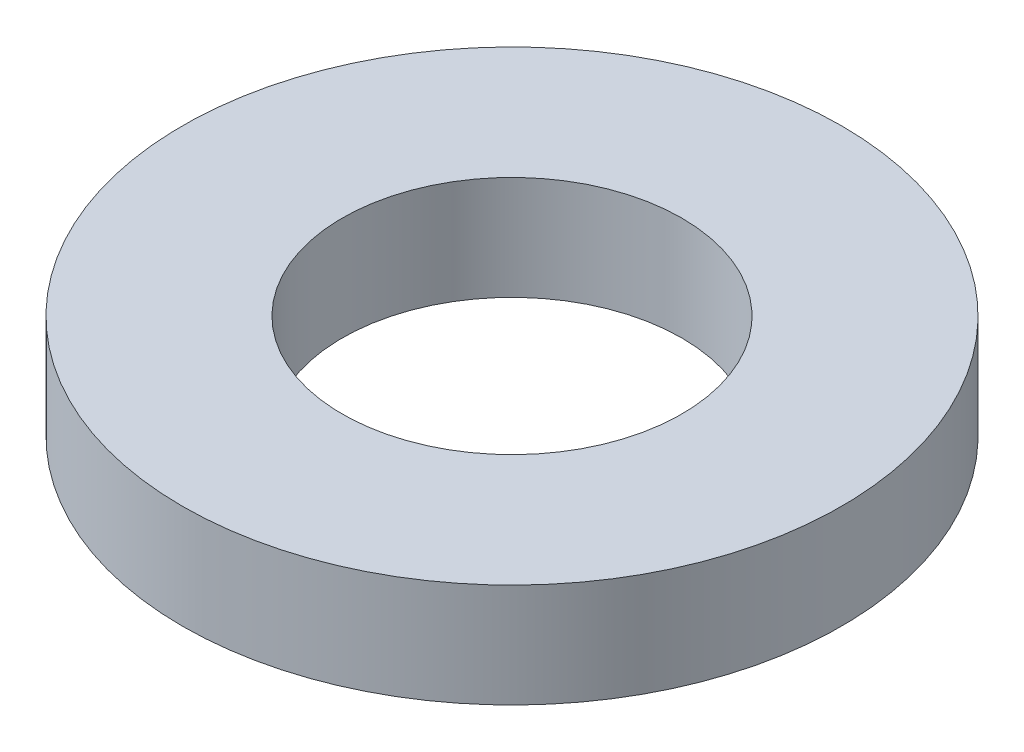
ISO-10303-21;
HEADER;
FILE_DESCRIPTION(('STEP AP214'),'2;1');
FILE_NAME('part.step','',(''),(''),'','','');
FILE_SCHEMA(('AUTOMOTIVE_DESIGN { 1 0 10303 214 1 1 1 1 }'));
ENDSEC;
DATA;
#1=APPLICATION_CONTEXT('core data for automotive mechanical design processes');
#2=APPLICATION_PROTOCOL_DEFINITION('international standard','automotive_design',2000,#1);
#3=PRODUCT_CONTEXT('',#1,'mechanical');
#4=PRODUCT('Part','Part','',(#3));
#5=PRODUCT_RELATED_PRODUCT_CATEGORY('part','',(#4));
#6=PRODUCT_DEFINITION_FORMATION('','',#4);
#7=PRODUCT_DEFINITION_CONTEXT('part definition',#1,'design');
#8=PRODUCT_DEFINITION('design','',#6,#7);
#9=PRODUCT_DEFINITION_SHAPE('','',#8);
#10=(LENGTH_UNIT() NAMED_UNIT(*) SI_UNIT(.MILLI.,.METRE.));
#11=(NAMED_UNIT(*) PLANE_ANGLE_UNIT() SI_UNIT($,.RADIAN.));
#12=(NAMED_UNIT(*) SI_UNIT($,.STERADIAN.) SOLID_ANGLE_UNIT());
#13=UNCERTAINTY_MEASURE_WITH_UNIT(LENGTH_MEASURE(1.E-05),#10,'distance_accuracy_value','');
#14=(GEOMETRIC_REPRESENTATION_CONTEXT(3) GLOBAL_UNCERTAINTY_ASSIGNED_CONTEXT((#13)) GLOBAL_UNIT_ASSIGNED_CONTEXT((#10,
#11,#12)) REPRESENTATION_CONTEXT('',''));
#15=CARTESIAN_POINT('',(0.,0.,0.));
#16=DIRECTION('',(0.,0.,1.));
#17=DIRECTION('',(1.,0.,0.));
#18=AXIS2_PLACEMENT_3D('',#15,#16,#17);
#19=CARTESIAN_POINT('',(0.,26.,0.));
#20=DIRECTION('',(0.,-1.,0.));
#21=DIRECTION('',(0.,0.,-1.));
#22=AXIS2_PLACEMENT_3D('',#19,#20,#21);
#23=CYLINDRICAL_SURFACE('',#22,82.5);
#24=CARTESIAN_POINT('',(0.,26.,0.));
#25=DIRECTION('',(0.,1.,0.));
#26=DIRECTION('',(0.,0.,1.));
#27=AXIS2_PLACEMENT_3D('',#24,#25,#26);
#28=CIRCLE('',#27,82.5);
#29=CARTESIAN_POINT('',(0.,26.,-82.5));
#30=VERTEX_POINT('',#29);
#31=EDGE_CURVE('E10',#30,#30,#28,.T.);
#32=CARTESIAN_POINT('',(0.,0.,0.));
#33=DIRECTION('',(0.,1.,0.));
#34=DIRECTION('',(0.,0.,1.));
#35=AXIS2_PLACEMENT_3D('',#32,#33,#34);
#36=CIRCLE('',#35,82.5);
#37=CARTESIAN_POINT('',(0.,0.,-82.5));
#38=VERTEX_POINT('',#37);
#39=EDGE_CURVE('E37',#38,#38,#36,.T.);
#40=CARTESIAN_POINT('',(0.,26.,-82.5));
#41=CARTESIAN_POINT('',(0.,25.7291666666667,-82.5));
#42=CARTESIAN_POINT('',(0.,25.4583333333333,-82.5));
#43=CARTESIAN_POINT('',(0.,24.9166666666667,-82.5));
#44=CARTESIAN_POINT('',(0.,24.6458333333333,-82.5));
#45=CARTESIAN_POINT('',(0.,24.1041666666667,-82.5));
#46=CARTESIAN_POINT('',(0.,23.8333333333333,-82.5));
#47=CARTESIAN_POINT('',(0.,23.2916666666667,-82.5));
#48=CARTESIAN_POINT('',(0.,23.0208333333333,-82.5));
#49=CARTESIAN_POINT('',(0.,22.4791666666667,-82.5));
#50=CARTESIAN_POINT('',(0.,22.2083333333333,-82.5));
#51=CARTESIAN_POINT('',(0.,21.6666666666667,-82.5));
#52=CARTESIAN_POINT('',(0.,21.3958333333333,-82.5));
#53=CARTESIAN_POINT('',(0.,20.8541666666667,-82.5));
#54=CARTESIAN_POINT('',(0.,20.5833333333333,-82.5));
#55=CARTESIAN_POINT('',(0.,20.0416666666667,-82.5));
#56=CARTESIAN_POINT('',(0.,19.7708333333333,-82.5));
#57=CARTESIAN_POINT('',(0.,19.2291666666667,-82.5));
#58=CARTESIAN_POINT('',(0.,18.9583333333333,-82.5));
#59=CARTESIAN_POINT('',(0.,18.4166666666667,-82.5));
#60=CARTESIAN_POINT('',(0.,18.1458333333333,-82.5));
#61=CARTESIAN_POINT('',(0.,17.6041666666667,-82.5));
#62=CARTESIAN_POINT('',(0.,17.3333333333333,-82.5));
#63=CARTESIAN_POINT('',(0.,16.7916666666667,-82.5));
#64=CARTESIAN_POINT('',(0.,16.5208333333333,-82.5));
#65=CARTESIAN_POINT('',(0.,15.9791666666667,-82.5));
#66=CARTESIAN_POINT('',(0.,15.7083333333333,-82.5));
#67=CARTESIAN_POINT('',(0.,15.1666666666667,-82.5));
#68=CARTESIAN_POINT('',(0.,14.8958333333333,-82.5));
#69=CARTESIAN_POINT('',(0.,14.3541666666667,-82.5));
#70=CARTESIAN_POINT('',(0.,14.0833333333333,-82.5));
#71=CARTESIAN_POINT('',(0.,13.5416666666667,-82.5));
#72=CARTESIAN_POINT('',(0.,13.2708333333333,-82.5));
#73=CARTESIAN_POINT('',(0.,12.7291666666667,-82.5));
#74=CARTESIAN_POINT('',(0.,12.4583333333333,-82.5));
#75=CARTESIAN_POINT('',(0.,11.9166666666667,-82.5));
#76=CARTESIAN_POINT('',(0.,11.6458333333333,-82.5));
#77=CARTESIAN_POINT('',(0.,11.1041666666667,-82.5));
#78=CARTESIAN_POINT('',(0.,10.8333333333333,-82.5));
#79=CARTESIAN_POINT('',(0.,10.2916666666667,-82.5));
#80=CARTESIAN_POINT('',(0.,10.0208333333333,-82.5));
#81=CARTESIAN_POINT('',(0.,9.47916666666667,-82.5));
#82=CARTESIAN_POINT('',(0.,9.20833333333333,-82.5));
#83=CARTESIAN_POINT('',(0.,8.66666666666667,-82.5));
#84=CARTESIAN_POINT('',(0.,8.39583333333333,-82.5));
#85=CARTESIAN_POINT('',(0.,7.85416666666667,-82.5));
#86=CARTESIAN_POINT('',(0.,7.58333333333333,-82.5));
#87=CARTESIAN_POINT('',(0.,7.04166666666667,-82.5));
#88=CARTESIAN_POINT('',(0.,6.77083333333333,-82.5));
#89=CARTESIAN_POINT('',(0.,6.22916666666667,-82.5));
#90=CARTESIAN_POINT('',(0.,5.95833333333333,-82.5));
#91=CARTESIAN_POINT('',(0.,5.41666666666667,-82.5));
#92=CARTESIAN_POINT('',(0.,5.14583333333333,-82.5));
#93=CARTESIAN_POINT('',(0.,4.60416666666667,-82.5));
#94=CARTESIAN_POINT('',(0.,4.33333333333333,-82.5));
#95=CARTESIAN_POINT('',(0.,3.79166666666667,-82.5));
#96=CARTESIAN_POINT('',(0.,3.52083333333333,-82.5));
#97=CARTESIAN_POINT('',(0.,2.97916666666667,-82.5));
#98=CARTESIAN_POINT('',(0.,2.70833333333333,-82.5));
#99=CARTESIAN_POINT('',(0.,2.16666666666667,-82.5));
#100=CARTESIAN_POINT('',(0.,1.89583333333333,-82.5));
#101=CARTESIAN_POINT('',(0.,1.35416666666667,-82.5));
#102=CARTESIAN_POINT('',(0.,1.08333333333333,-82.5));
#103=CARTESIAN_POINT('',(0.,0.541666666666667,-82.5));
#104=CARTESIAN_POINT('',(0.,0.270833333333334,-82.5));
#105=CARTESIAN_POINT('',(0.,0.,-82.5));
#106=B_SPLINE_CURVE_WITH_KNOTS('',3,(#40,#41,#42,#43,#44,#45,#46,#47,#48,#49,#50,#51,#52,#53,
#54,#55,#56,#57,#58,#59,#60,#61,#62,#63,#64,#65,#66,#67,#68,#69,#70,#71,#72,#73,#74,#75,#76,#77,
#78,#79,#80,#81,#82,#83,#84,#85,#86,#87,#88,#89,#90,#91,#92,#93,#94,#95,#96,#97,#98,#99,#100,
#101,#102,#103,#104,#105),.UNSPECIFIED.,.F.,.F.,(4,2,2,2,2,2,2,2,2,2,2,2,2,2,2,2,2,2,2,2,2,2,2,
2,2,2,2,2,2,2,2,2,4),(0.,0.812500000000001,1.625,2.4375,3.25,4.0625,4.875,5.6875,6.5,7.3125,
8.125,8.9375,9.75,10.5625,11.375,12.1875,13.,13.8125,14.625,15.4375,16.25,17.0625,17.875,
18.6875,19.5,20.3125,21.125,21.9375,22.75,23.5625,24.375,25.1875,26.),.UNSPECIFIED.);
#107=EDGE_CURVE('BSEAM40',#30,#38,#106,.T.);
#108=ORIENTED_EDGE('',*,*,#31,.F.);
#109=ORIENTED_EDGE('',*,*,#39,.T.);
#110=ORIENTED_EDGE('',*,*,#107,.T.);
#111=ORIENTED_EDGE('',*,*,#107,.F.);
#112=EDGE_LOOP('',(#108,#110,#109,#111));
#113=FACE_BOUND('',#112,.T.);
#114=ADVANCED_FACE('F40',(#113),#23,.T.);
#115=CARTESIAN_POINT('',(0.,26.,0.));
#116=DIRECTION('',(0.,1.,0.));
#117=DIRECTION('',(0.,0.,1.));
#118=AXIS2_PLACEMENT_3D('',#115,#116,#117);
#119=PLANE('',#118);
#120=CARTESIAN_POINT('',(0.,26.,0.));
#121=DIRECTION('',(0.,1.,0.));
#122=DIRECTION('',(0.,0.,1.));
#123=AXIS2_PLACEMENT_3D('',#120,#121,#122);
#124=CIRCLE('',#123,42.5);
#125=CARTESIAN_POINT('',(0.,26.,-42.5));
#126=VERTEX_POINT('',#125);
#127=EDGE_CURVE('E50',#126,#126,#124,.T.);
#128=ORIENTED_EDGE('',*,*,#127,.F.);
#129=EDGE_LOOP('',(#128));
#130=FACE_BOUND('',#129,.T.);
#131=ORIENTED_EDGE('',*,*,#31,.T.);
#132=EDGE_LOOP('',(#131));
#133=FACE_BOUND('',#132,.T.);
#134=ADVANCED_FACE('F59',(#130,#133),#119,.T.);
#135=CARTESIAN_POINT('',(0.,0.,0.));
#136=DIRECTION('',(0.,1.,0.));
#137=DIRECTION('',(0.,0.,1.));
#138=AXIS2_PLACEMENT_3D('',#135,#136,#137);
#139=PLANE('',#138);
#140=CARTESIAN_POINT('',(0.,0.,0.));
#141=DIRECTION('',(0.,1.,0.));
#142=DIRECTION('',(0.,0.,1.));
#143=AXIS2_PLACEMENT_3D('',#140,#141,#142);
#144=CIRCLE('',#143,42.5);
#145=CARTESIAN_POINT('',(0.,0.,-42.5));
#146=VERTEX_POINT('',#145);
#147=EDGE_CURVE('E47',#146,#146,#144,.T.);
#148=ORIENTED_EDGE('',*,*,#147,.T.);
#149=EDGE_LOOP('',(#148));
#150=FACE_BOUND('',#149,.T.);
#151=ORIENTED_EDGE('',*,*,#39,.F.);
#152=EDGE_LOOP('',(#151));
#153=FACE_BOUND('',#152,.T.);
#154=ADVANCED_FACE('F58',(#150,#153),#139,.F.);
#155=CARTESIAN_POINT('',(0.,26.,0.));
#156=DIRECTION('',(0.,-1.,0.));
#157=DIRECTION('',(0.,0.,-1.));
#158=AXIS2_PLACEMENT_3D('',#155,#156,#157);
#159=CYLINDRICAL_SURFACE('',#158,42.5);
#160=CARTESIAN_POINT('',(0.,26.,-42.5));
#161=CARTESIAN_POINT('',(0.,25.7291666666667,-42.5));
#162=CARTESIAN_POINT('',(0.,25.4583333333333,-42.5));
#163=CARTESIAN_POINT('',(0.,24.9166666666667,-42.5));
#164=CARTESIAN_POINT('',(0.,24.6458333333333,-42.5));
#165=CARTESIAN_POINT('',(0.,24.1041666666667,-42.5));
#166=CARTESIAN_POINT('',(0.,23.8333333333333,-42.5));
#167=CARTESIAN_POINT('',(0.,23.2916666666667,-42.5));
#168=CARTESIAN_POINT('',(0.,23.0208333333333,-42.5));
#169=CARTESIAN_POINT('',(0.,22.4791666666667,-42.5));
#170=CARTESIAN_POINT('',(0.,22.2083333333333,-42.5));
#171=CARTESIAN_POINT('',(0.,21.6666666666667,-42.5));
#172=CARTESIAN_POINT('',(0.,21.3958333333333,-42.5));
#173=CARTESIAN_POINT('',(0.,20.8541666666667,-42.5));
#174=CARTESIAN_POINT('',(0.,20.5833333333333,-42.5));
#175=CARTESIAN_POINT('',(0.,20.0416666666667,-42.5));
#176=CARTESIAN_POINT('',(0.,19.7708333333333,-42.5));
#177=CARTESIAN_POINT('',(0.,19.2291666666667,-42.5));
#178=CARTESIAN_POINT('',(0.,18.9583333333333,-42.5));
#179=CARTESIAN_POINT('',(0.,18.4166666666667,-42.5));
#180=CARTESIAN_POINT('',(0.,18.1458333333333,-42.5));
#181=CARTESIAN_POINT('',(0.,17.6041666666667,-42.5));
#182=CARTESIAN_POINT('',(0.,17.3333333333333,-42.5));
#183=CARTESIAN_POINT('',(0.,16.7916666666667,-42.5));
#184=CARTESIAN_POINT('',(0.,16.5208333333333,-42.5));
#185=CARTESIAN_POINT('',(0.,15.9791666666667,-42.5));
#186=CARTESIAN_POINT('',(0.,15.7083333333333,-42.5));
#187=CARTESIAN_POINT('',(0.,15.1666666666667,-42.5));
#188=CARTESIAN_POINT('',(0.,14.8958333333333,-42.5));
#189=CARTESIAN_POINT('',(0.,14.3541666666667,-42.5));
#190=CARTESIAN_POINT('',(0.,14.0833333333333,-42.5));
#191=CARTESIAN_POINT('',(0.,13.5416666666667,-42.5));
#192=CARTESIAN_POINT('',(0.,13.2708333333333,-42.5));
#193=CARTESIAN_POINT('',(0.,12.7291666666667,-42.5));
#194=CARTESIAN_POINT('',(0.,12.4583333333333,-42.5));
#195=CARTESIAN_POINT('',(0.,11.9166666666667,-42.5));
#196=CARTESIAN_POINT('',(0.,11.6458333333333,-42.5));
#197=CARTESIAN_POINT('',(0.,11.1041666666667,-42.5));
#198=CARTESIAN_POINT('',(0.,10.8333333333333,-42.5));
#199=CARTESIAN_POINT('',(0.,10.2916666666667,-42.5));
#200=CARTESIAN_POINT('',(0.,10.0208333333333,-42.5));
#201=CARTESIAN_POINT('',(0.,9.47916666666667,-42.5));
#202=CARTESIAN_POINT('',(0.,9.20833333333333,-42.5));
#203=CARTESIAN_POINT('',(0.,8.66666666666667,-42.5));
#204=CARTESIAN_POINT('',(0.,8.39583333333333,-42.5));
#205=CARTESIAN_POINT('',(0.,7.85416666666667,-42.5));
#206=CARTESIAN_POINT('',(0.,7.58333333333333,-42.5));
#207=CARTESIAN_POINT('',(0.,7.04166666666667,-42.5));
#208=CARTESIAN_POINT('',(0.,6.77083333333333,-42.5));
#209=CARTESIAN_POINT('',(0.,6.22916666666667,-42.5));
#210=CARTESIAN_POINT('',(0.,5.95833333333333,-42.5));
#211=CARTESIAN_POINT('',(0.,5.41666666666667,-42.5));
#212=CARTESIAN_POINT('',(0.,5.14583333333333,-42.5));
#213=CARTESIAN_POINT('',(0.,4.60416666666667,-42.5));
#214=CARTESIAN_POINT('',(0.,4.33333333333333,-42.5));
#215=CARTESIAN_POINT('',(0.,3.79166666666667,-42.5));
#216=CARTESIAN_POINT('',(0.,3.52083333333333,-42.5));
#217=CARTESIAN_POINT('',(0.,2.97916666666667,-42.5));
#218=CARTESIAN_POINT('',(0.,2.70833333333333,-42.5));
#219=CARTESIAN_POINT('',(0.,2.16666666666667,-42.5));
#220=CARTESIAN_POINT('',(0.,1.89583333333333,-42.5));
#221=CARTESIAN_POINT('',(0.,1.35416666666667,-42.5));
#222=CARTESIAN_POINT('',(0.,1.08333333333333,-42.5));
#223=CARTESIAN_POINT('',(0.,0.541666666666667,-42.5));
#224=CARTESIAN_POINT('',(0.,0.270833333333334,-42.5));
#225=CARTESIAN_POINT('',(0.,0.,-42.5));
#226=B_SPLINE_CURVE_WITH_KNOTS('',3,(#160,#161,#162,#163,#164,#165,#166,#167,#168,#169,#170,
#171,#172,#173,#174,#175,#176,#177,#178,#179,#180,#181,#182,#183,#184,#185,#186,#187,#188,#189,
#190,#191,#192,#193,#194,#195,#196,#197,#198,#199,#200,#201,#202,#203,#204,#205,#206,#207,#208,
#209,#210,#211,#212,#213,#214,#215,#216,#217,#218,#219,#220,#221,#222,#223,#224,#225),
.UNSPECIFIED.,.F.,.F.,(4,2,2,2,2,2,2,2,2,2,2,2,2,2,2,2,2,2,2,2,2,2,2,2,2,2,2,2,2,2,2,2,4),(0.,
0.812499999999997,1.625,2.4375,3.25,4.0625,4.875,5.6875,6.5,7.3125,8.125,8.93749999999999,
9.74999999999999,10.5625,11.375,12.1875,13.,13.8125,14.625,15.4375,16.25,17.0625,17.875,18.6875,
19.5,20.3125,21.125,21.9375,22.75,23.5625,24.375,25.1875,26.),.UNSPECIFIED.);
#227=EDGE_CURVE('BSEAM54',#126,#146,#226,.T.);
#228=ORIENTED_EDGE('',*,*,#127,.T.);
#229=ORIENTED_EDGE('',*,*,#147,.F.);
#230=ORIENTED_EDGE('',*,*,#227,.T.);
#231=ORIENTED_EDGE('',*,*,#227,.F.);
#232=EDGE_LOOP('',(#228,#230,#229,#231));
#233=FACE_BOUND('',#232,.T.);
#234=ADVANCED_FACE('F54',(#233),#159,.F.);
#235=CLOSED_SHELL('',(#114,#134,#154,#234));
#236=MANIFOLD_SOLID_BREP('B2',#235);
#237=ADVANCED_BREP_SHAPE_REPRESENTATION('',(#18,#236),#14);
#238=SHAPE_DEFINITION_REPRESENTATION(#9,#237);
ENDSEC;
END-ISO-10303-21;
